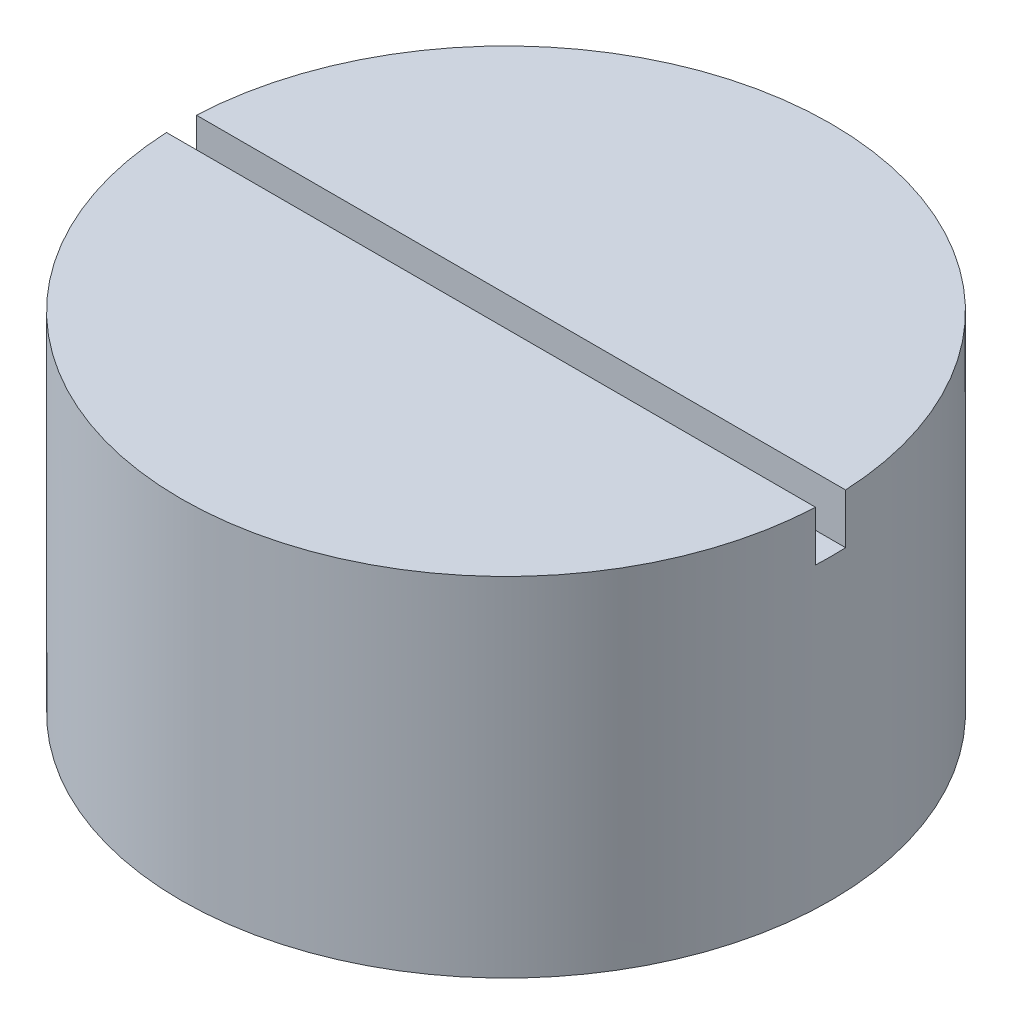
ISO-10303-21;
HEADER;
FILE_DESCRIPTION(('STEP AP214'),'2;1');
FILE_NAME('part.step','',(''),(''),'','','');
FILE_SCHEMA(('AUTOMOTIVE_DESIGN { 1 0 10303 214 1 1 1 1 }'));
ENDSEC;
DATA;
#1=APPLICATION_CONTEXT('core data for automotive mechanical design processes');
#2=APPLICATION_PROTOCOL_DEFINITION('international standard','automotive_design',2000,#1);
#3=PRODUCT_CONTEXT('',#1,'mechanical');
#4=PRODUCT('Part','Part','',(#3));
#5=PRODUCT_RELATED_PRODUCT_CATEGORY('part','',(#4));
#6=PRODUCT_DEFINITION_FORMATION('','',#4);
#7=PRODUCT_DEFINITION_CONTEXT('part definition',#1,'design');
#8=PRODUCT_DEFINITION('design','',#6,#7);
#9=PRODUCT_DEFINITION_SHAPE('','',#8);
#10=(LENGTH_UNIT() NAMED_UNIT(*) SI_UNIT(.MILLI.,.METRE.));
#11=(NAMED_UNIT(*) PLANE_ANGLE_UNIT() SI_UNIT($,.RADIAN.));
#12=(NAMED_UNIT(*) SI_UNIT($,.STERADIAN.) SOLID_ANGLE_UNIT());
#13=UNCERTAINTY_MEASURE_WITH_UNIT(LENGTH_MEASURE(1.E-05),#10,'distance_accuracy_value','');
#14=(GEOMETRIC_REPRESENTATION_CONTEXT(3) GLOBAL_UNCERTAINTY_ASSIGNED_CONTEXT((#13)) GLOBAL_UNIT_ASSIGNED_CONTEXT((#10,
#11,#12)) REPRESENTATION_CONTEXT('',''));
#15=CARTESIAN_POINT('',(0.,0.,0.));
#16=DIRECTION('',(0.,0.,1.));
#17=DIRECTION('',(1.,0.,0.));
#18=AXIS2_PLACEMENT_3D('',#15,#16,#17);
#19=CARTESIAN_POINT('',(0.,34.793,0.));
#20=DIRECTION('',(0.,1.,0.));
#21=DIRECTION('',(0.,0.,1.));
#22=AXIS2_PLACEMENT_3D('',#19,#20,#21);
#23=PLANE('',#22);
#24=DIRECTION('',(1.,0.,0.));
#25=VECTOR('',#24,1.);
#26=CARTESIAN_POINT('',(0.,34.793,1.5));
#27=LINE('',#26,#25);
#28=CARTESIAN_POINT('',(-32.4653661614959,34.793,1.5));
#29=VERTEX_POINT('',#28);
#30=CARTESIAN_POINT('',(32.4653661614959,34.793,1.5));
#31=VERTEX_POINT('',#30);
#32=EDGE_CURVE('E89',#29,#31,#27,.T.);
#33=ORIENTED_EDGE('',*,*,#32,.F.);
#34=CARTESIAN_POINT('',(0.,34.793,0.));
#35=DIRECTION('',(0.,1.,0.));
#36=DIRECTION('',(0.,0.,1.));
#37=AXIS2_PLACEMENT_3D('',#34,#35,#36);
#38=CIRCLE('',#37,32.5);
#39=EDGE_CURVE('E101',#29,#31,#38,.T.);
#40=ORIENTED_EDGE('',*,*,#39,.T.);
#41=EDGE_LOOP('',(#33,#40));
#42=FACE_BOUND('',#41,.T.);
#43=ADVANCED_FACE('F39',(#42),#23,.T.);
#44=CARTESIAN_POINT('',(0.,34.793,0.));
#45=DIRECTION('',(0.,-1.,0.));
#46=DIRECTION('',(0.,0.,-1.));
#47=AXIS2_PLACEMENT_3D('',#44,#45,#46);
#48=CYLINDRICAL_SURFACE('',#47,32.5);
#49=CARTESIAN_POINT('',(0.,29.793,0.));
#50=DIRECTION('',(0.,-1.,0.));
#51=DIRECTION('',(0.,0.,-1.));
#52=AXIS2_PLACEMENT_3D('',#49,#50,#51);
#53=CIRCLE('',#52,32.5);
#54=CARTESIAN_POINT('',(32.4653661614959,29.793,-1.5));
#55=VERTEX_POINT('',#54);
#56=CARTESIAN_POINT('',(32.4653661614959,29.793,1.5));
#57=VERTEX_POINT('',#56);
#58=EDGE_CURVE('E11',#55,#57,#53,.T.);
#59=ORIENTED_EDGE('',*,*,#58,.T.);
#60=DIRECTION('',(0.,-1.,0.));
#61=VECTOR('',#60,1.);
#62=CARTESIAN_POINT('',(32.4653661614958,34.793,1.5));
#63=LINE('',#62,#61);
#64=EDGE_CURVE('E63',#57,#31,#63,.F.);
#65=ORIENTED_EDGE('',*,*,#64,.T.);
#66=ORIENTED_EDGE('',*,*,#39,.F.);
#67=DIRECTION('',(0.,-1.,0.));
#68=VECTOR('',#67,1.);
#69=CARTESIAN_POINT('',(-32.4653661614958,34.793,1.5));
#70=LINE('',#69,#68);
#71=CARTESIAN_POINT('',(-32.4653661614959,29.793,1.5));
#72=VERTEX_POINT('',#71);
#73=EDGE_CURVE('E108',#29,#72,#70,.T.);
#74=ORIENTED_EDGE('',*,*,#73,.T.);
#75=CARTESIAN_POINT('',(-32.4653661614959,29.793,-1.5));
#76=VERTEX_POINT('',#75);
#77=EDGE_CURVE('E43',#72,#76,#53,.T.);
#78=ORIENTED_EDGE('',*,*,#77,.T.);
#79=DIRECTION('',(0.,-1.,0.));
#80=VECTOR('',#79,1.);
#81=CARTESIAN_POINT('',(-32.4653661614958,34.793,-1.5));
#82=LINE('',#81,#80);
#83=CARTESIAN_POINT('',(-32.4653661614959,34.793,-1.5));
#84=VERTEX_POINT('',#83);
#85=EDGE_CURVE('E83',#76,#84,#82,.F.);
#86=ORIENTED_EDGE('',*,*,#85,.T.);
#87=CARTESIAN_POINT('',(32.4653661614959,34.793,-1.5));
#88=VERTEX_POINT('',#87);
#89=EDGE_CURVE('E90',#88,#84,#38,.T.);
#90=ORIENTED_EDGE('',*,*,#89,.F.);
#91=DIRECTION('',(0.,-1.,0.));
#92=VECTOR('',#91,1.);
#93=CARTESIAN_POINT('',(32.4653661614958,34.793,-1.5));
#94=LINE('',#93,#92);
#95=EDGE_CURVE('E55',#88,#55,#94,.T.);
#96=ORIENTED_EDGE('',*,*,#95,.T.);
#97=EDGE_LOOP('',(#59,#65,#66,#74,#78,#86,#90,#96));
#98=FACE_BOUND('',#97,.T.);
#99=CARTESIAN_POINT('',(0.,0.,0.));
#100=DIRECTION('',(0.,1.,0.));
#101=DIRECTION('',(0.,0.,1.));
#102=AXIS2_PLACEMENT_3D('',#99,#100,#101);
#103=CIRCLE('',#102,32.5);
#104=CARTESIAN_POINT('',(0.,0.,32.5));
#105=VERTEX_POINT('',#104);
#106=EDGE_CURVE('E105',#105,#105,#103,.T.);
#107=ORIENTED_EDGE('',*,*,#106,.T.);
#108=EDGE_LOOP('',(#107));
#109=FACE_BOUND('',#108,.T.);
#110=ADVANCED_FACE('F41',(#98,#109),#48,.T.);
#111=DIRECTION('',(-1.,0.,0.));
#112=VECTOR('',#111,1.);
#113=CARTESIAN_POINT('',(0.,34.793,-1.5));
#114=LINE('',#113,#112);
#115=EDGE_CURVE('E80',#88,#84,#114,.T.);
#116=ORIENTED_EDGE('',*,*,#115,.F.);
#117=ORIENTED_EDGE('',*,*,#89,.T.);
#118=EDGE_LOOP('',(#116,#117));
#119=FACE_BOUND('',#118,.T.);
#120=ADVANCED_FACE('F99',(#119),#23,.T.);
#121=CARTESIAN_POINT('',(0.,0.,0.));
#122=DIRECTION('',(0.,1.,0.));
#123=DIRECTION('',(0.,0.,1.));
#124=AXIS2_PLACEMENT_3D('',#121,#122,#123);
#125=PLANE('',#124);
#126=CARTESIAN_POINT('',(0.,0.,0.));
#127=DIRECTION('',(0.,-1.,0.));
#128=DIRECTION('',(0.,0.,-1.));
#129=AXIS2_PLACEMENT_3D('',#126,#127,#128);
#130=CIRCLE('',#129,8.);
#131=CARTESIAN_POINT('',(0.,0.,-8.));
#132=VERTEX_POINT('',#131);
#133=EDGE_CURVE('E158',#132,#132,#130,.T.);
#134=ORIENTED_EDGE('',*,*,#133,.F.);
#135=EDGE_LOOP('',(#134));
#136=FACE_BOUND('',#135,.T.);
#137=ORIENTED_EDGE('',*,*,#106,.F.);
#138=EDGE_LOOP('',(#137));
#139=FACE_BOUND('',#138,.T.);
#140=ADVANCED_FACE('F126',(#136,#139),#125,.F.);
#141=CARTESIAN_POINT('',(0.,29.793,0.));
#142=DIRECTION('',(0.,-1.,0.));
#143=DIRECTION('',(0.,0.,-1.));
#144=AXIS2_PLACEMENT_3D('',#141,#142,#143);
#145=PLANE('',#144);
#146=DIRECTION('',(-1.,0.,0.));
#147=VECTOR('',#146,1.);
#148=CARTESIAN_POINT('',(-33.1900761015897,29.793,-1.5));
#149=LINE('',#148,#147);
#150=EDGE_CURVE('E165',#55,#76,#149,.T.);
#151=ORIENTED_EDGE('',*,*,#150,.T.);
#152=ORIENTED_EDGE('',*,*,#77,.F.);
#153=DIRECTION('',(1.,0.,0.));
#154=VECTOR('',#153,1.);
#155=CARTESIAN_POINT('',(-33.1900761015897,29.793,1.5));
#156=LINE('',#155,#154);
#157=EDGE_CURVE('E97',#72,#57,#156,.T.);
#158=ORIENTED_EDGE('',*,*,#157,.T.);
#159=ORIENTED_EDGE('',*,*,#58,.F.);
#160=EDGE_LOOP('',(#151,#152,#158,#159));
#161=FACE_BOUND('',#160,.T.);
#162=ADVANCED_FACE('F130',(#161),#145,.F.);
#163=CARTESIAN_POINT('',(-33.1900761015897,29.793,1.5));
#164=DIRECTION('',(0.,0.,1.));
#165=DIRECTION('',(1.,0.,0.));
#166=AXIS2_PLACEMENT_3D('',#163,#164,#165);
#167=PLANE('',#166);
#168=ORIENTED_EDGE('',*,*,#32,.T.);
#169=ORIENTED_EDGE('',*,*,#64,.F.);
#170=ORIENTED_EDGE('',*,*,#157,.F.);
#171=ORIENTED_EDGE('',*,*,#73,.F.);
#172=EDGE_LOOP('',(#168,#169,#170,#171));
#173=FACE_BOUND('',#172,.T.);
#174=ADVANCED_FACE('F115',(#173),#167,.F.);
#175=CARTESIAN_POINT('',(-33.1900761015897,29.793,-1.5));
#176=DIRECTION('',(0.,0.,-1.));
#177=DIRECTION('',(-1.,0.,0.));
#178=AXIS2_PLACEMENT_3D('',#175,#176,#177);
#179=PLANE('',#178);
#180=ORIENTED_EDGE('',*,*,#115,.T.);
#181=ORIENTED_EDGE('',*,*,#85,.F.);
#182=ORIENTED_EDGE('',*,*,#150,.F.);
#183=ORIENTED_EDGE('',*,*,#95,.F.);
#184=EDGE_LOOP('',(#180,#181,#182,#183));
#185=FACE_BOUND('',#184,.T.);
#186=ADVANCED_FACE('F82',(#185),#179,.F.);
#187=CARTESIAN_POINT('',(0.,2.,0.));
#188=DIRECTION('',(0.,-1.,0.));
#189=DIRECTION('',(0.,0.,-1.));
#190=AXIS2_PLACEMENT_3D('',#187,#188,#189);
#191=CYLINDRICAL_SURFACE('',#190,8.);
#192=CARTESIAN_POINT('',(0.,2.,0.));
#193=DIRECTION('',(0.,-1.,0.));
#194=DIRECTION('',(0.,0.,-1.));
#195=AXIS2_PLACEMENT_3D('',#192,#193,#194);
#196=CIRCLE('',#195,8.);
#197=CARTESIAN_POINT('',(0.,2.,-8.));
#198=VERTEX_POINT('',#197);
#199=EDGE_CURVE('E161',#198,#198,#196,.T.);
#200=ORIENTED_EDGE('',*,*,#199,.F.);
#201=EDGE_LOOP('',(#200));
#202=FACE_BOUND('',#201,.T.);
#203=ORIENTED_EDGE('',*,*,#133,.T.);
#204=EDGE_LOOP('',(#203));
#205=FACE_BOUND('',#204,.T.);
#206=ADVANCED_FACE('F176',(#202,#205),#191,.F.);
#207=CARTESIAN_POINT('',(0.,2.,0.));
#208=DIRECTION('',(0.,-1.,0.));
#209=DIRECTION('',(0.,0.,-1.));
#210=AXIS2_PLACEMENT_3D('',#207,#208,#209);
#211=PLANE('',#210);
#212=CARTESIAN_POINT('',(0.,2.,0.));
#213=DIRECTION('',(0.,-1.,0.));
#214=DIRECTION('',(0.,0.,-1.));
#215=AXIS2_PLACEMENT_3D('',#212,#213,#214);
#216=CIRCLE('',#215,6.);
#217=CARTESIAN_POINT('',(0.,2.,-6.));
#218=VERTEX_POINT('',#217);
#219=EDGE_CURVE('E154',#218,#218,#216,.T.);
#220=ORIENTED_EDGE('',*,*,#219,.F.);
#221=EDGE_LOOP('',(#220));
#222=FACE_BOUND('',#221,.T.);
#223=ORIENTED_EDGE('',*,*,#199,.T.);
#224=EDGE_LOOP('',(#223));
#225=FACE_BOUND('',#224,.T.);
#226=ADVANCED_FACE('F146',(#222,#225),#211,.T.);
#227=CARTESIAN_POINT('',(0.,2.,0.));
#228=DIRECTION('',(0.,-1.,0.));
#229=DIRECTION('',(0.,0.,-1.));
#230=AXIS2_PLACEMENT_3D('',#227,#228,#229);
#231=CYLINDRICAL_SURFACE('',#230,6.);
#232=ORIENTED_EDGE('',*,*,#219,.T.);
#233=EDGE_LOOP('',(#232));
#234=FACE_BOUND('',#233,.T.);
#235=CARTESIAN_POINT('',(0.,0.,0.));
#236=DIRECTION('',(0.,-1.,0.));
#237=DIRECTION('',(0.,0.,-1.));
#238=AXIS2_PLACEMENT_3D('',#235,#236,#237);
#239=CIRCLE('',#238,6.);
#240=CARTESIAN_POINT('',(0.,0.,-6.));
#241=VERTEX_POINT('',#240);
#242=EDGE_CURVE('E151',#241,#241,#239,.T.);
#243=ORIENTED_EDGE('',*,*,#242,.F.);
#244=EDGE_LOOP('',(#243));
#245=FACE_BOUND('',#244,.T.);
#246=ADVANCED_FACE('F141',(#234,#245),#231,.T.);
#247=ORIENTED_EDGE('',*,*,#242,.T.);
#248=EDGE_LOOP('',(#247));
#249=FACE_BOUND('',#248,.T.);
#250=ADVANCED_FACE('F132',(#249),#125,.F.);
#251=CLOSED_SHELL('',(#43,#110,#120,#140,#162,#174,#186,#206,#226,#246,#250));
#252=MANIFOLD_SOLID_BREP('B2',#251);
#253=ADVANCED_BREP_SHAPE_REPRESENTATION('',(#18,#252),#14);
#254=SHAPE_DEFINITION_REPRESENTATION(#9,#253);
ENDSEC;
END-ISO-10303-21;
